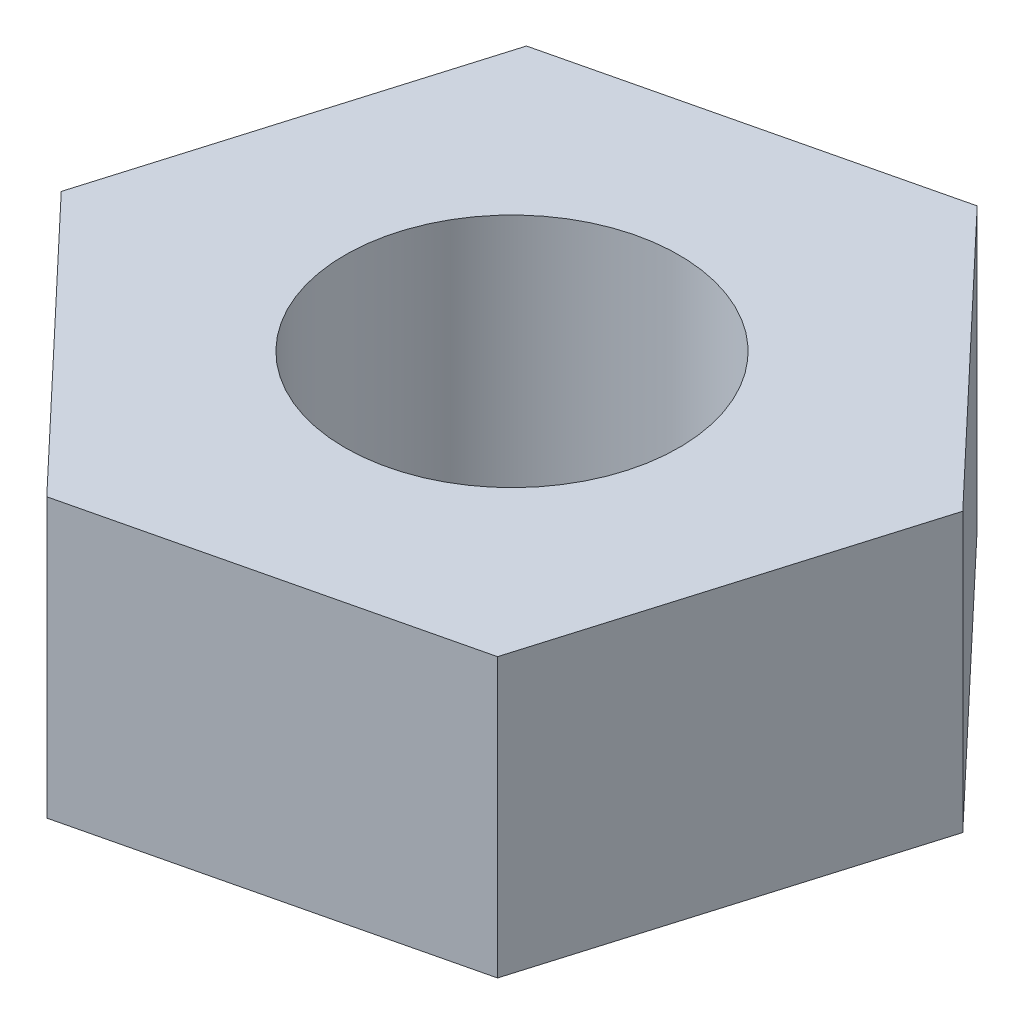
ISO-10303-21;
HEADER;
FILE_DESCRIPTION(('STEP AP214'),'2;1');
FILE_NAME('part.step','',(''),(''),'','','');
FILE_SCHEMA(('AUTOMOTIVE_DESIGN { 1 0 10303 214 1 1 1 1 }'));
ENDSEC;
DATA;
#1=APPLICATION_CONTEXT('core data for automotive mechanical design processes');
#2=APPLICATION_PROTOCOL_DEFINITION('international standard','automotive_design',2000,#1);
#3=PRODUCT_CONTEXT('',#1,'mechanical');
#4=PRODUCT('Part','Part','',(#3));
#5=PRODUCT_RELATED_PRODUCT_CATEGORY('part','',(#4));
#6=PRODUCT_DEFINITION_FORMATION('','',#4);
#7=PRODUCT_DEFINITION_CONTEXT('part definition',#1,'design');
#8=PRODUCT_DEFINITION('design','',#6,#7);
#9=PRODUCT_DEFINITION_SHAPE('','',#8);
#10=(LENGTH_UNIT() NAMED_UNIT(*) SI_UNIT(.MILLI.,.METRE.));
#11=(NAMED_UNIT(*) PLANE_ANGLE_UNIT() SI_UNIT($,.RADIAN.));
#12=(NAMED_UNIT(*) SI_UNIT($,.STERADIAN.) SOLID_ANGLE_UNIT());
#13=UNCERTAINTY_MEASURE_WITH_UNIT(LENGTH_MEASURE(1.E-05),#10,'distance_accuracy_value','');
#14=(GEOMETRIC_REPRESENTATION_CONTEXT(3) GLOBAL_UNCERTAINTY_ASSIGNED_CONTEXT((#13)) GLOBAL_UNIT_ASSIGNED_CONTEXT((#10,
#11,#12)) REPRESENTATION_CONTEXT('',''));
#15=CARTESIAN_POINT('',(0.,0.,0.));
#16=DIRECTION('',(0.,0.,1.));
#17=DIRECTION('',(1.,0.,0.));
#18=AXIS2_PLACEMENT_3D('',#15,#16,#17);
#19=CARTESIAN_POINT('',(-3.83322413342985,10.,12.8843393939421));
#20=DIRECTION('',(-0.232286318493333,0.,-0.972647452184405));
#21=DIRECTION('',(-0.972647452184405,0.,0.232286318493333));
#22=AXIS2_PLACEMENT_3D('',#19,#20,#21);
#23=PLANE('',#22);
#24=DIRECTION('',(0.972647452184405,0.,-0.232286318493333));
#25=VECTOR('',#24,1.);
#26=CARTESIAN_POINT('',(-3.83322413342985,0.,12.8843393939421));
#27=LINE('',#26,#25);
#28=CARTESIAN_POINT('',(-3.83322413342985,0.,12.8843393939421));
#29=VERTEX_POINT('',#28);
#30=CARTESIAN_POINT('',(9.24155315941951,0.,9.76183917492088));
#31=VERTEX_POINT('',#30);
#32=EDGE_CURVE('E117',#29,#31,#27,.T.);
#33=ORIENTED_EDGE('',*,*,#32,.T.);
#34=DIRECTION('',(0.,-1.,0.));
#35=VECTOR('',#34,1.);
#36=CARTESIAN_POINT('',(9.24155315941951,10.,9.76183917492088));
#37=LINE('',#36,#35);
#38=CARTESIAN_POINT('',(9.24155315941951,10.,9.76183917492088));
#39=VERTEX_POINT('',#38);
#40=EDGE_CURVE('E11',#39,#31,#37,.T.);
#41=ORIENTED_EDGE('',*,*,#40,.F.);
#42=DIRECTION('',(0.972647452184405,0.,-0.232286318493333));
#43=VECTOR('',#42,1.);
#44=CARTESIAN_POINT('',(-3.83322413342985,10.,12.8843393939421));
#45=LINE('',#44,#43);
#46=CARTESIAN_POINT('',(-3.83322413342985,10.,12.8843393939421));
#47=VERTEX_POINT('',#46);
#48=EDGE_CURVE('E128',#47,#39,#45,.T.);
#49=ORIENTED_EDGE('',*,*,#48,.F.);
#50=DIRECTION('',(0.,-1.,0.));
#51=VECTOR('',#50,1.);
#52=CARTESIAN_POINT('',(-3.83322413342985,10.,12.8843393939421));
#53=LINE('',#52,#51);
#54=EDGE_CURVE('E113',#47,#29,#53,.T.);
#55=ORIENTED_EDGE('',*,*,#54,.T.);
#56=EDGE_LOOP('',(#33,#41,#49,#55));
#57=FACE_BOUND('',#56,.T.);
#58=ADVANCED_FACE('F33',(#57),#23,.F.);
#59=CARTESIAN_POINT('',(9.24155315941951,10.,9.76183917492088));
#60=DIRECTION('',(-0.958480561764571,0.,-0.285157873325412));
#61=DIRECTION('',(-0.285157873325413,0.,0.958480561764571));
#62=AXIS2_PLACEMENT_3D('',#59,#60,#61);
#63=PLANE('',#62);
#64=DIRECTION('',(0.285157873325412,0.,-0.958480561764571));
#65=VECTOR('',#64,1.);
#66=CARTESIAN_POINT('',(9.24155315941951,0.,9.76183917492088));
#67=LINE('',#66,#65);
#68=CARTESIAN_POINT('',(13.0747772928494,0.,-3.1225002190212));
#69=VERTEX_POINT('',#68);
#70=EDGE_CURVE('E120',#31,#69,#67,.T.);
#71=ORIENTED_EDGE('',*,*,#70,.T.);
#72=DIRECTION('',(0.,-1.,0.));
#73=VECTOR('',#72,1.);
#74=CARTESIAN_POINT('',(13.0747772928494,10.,-3.1225002190212));
#75=LINE('',#74,#73);
#76=CARTESIAN_POINT('',(13.0747772928494,10.,-3.1225002190212));
#77=VERTEX_POINT('',#76);
#78=EDGE_CURVE('E41',#77,#69,#75,.T.);
#79=ORIENTED_EDGE('',*,*,#78,.F.);
#80=DIRECTION('',(0.285157873325412,0.,-0.958480561764571));
#81=VECTOR('',#80,1.);
#82=CARTESIAN_POINT('',(9.24155315941951,10.,9.76183917492088));
#83=LINE('',#82,#81);
#84=EDGE_CURVE('E86',#39,#77,#83,.T.);
#85=ORIENTED_EDGE('',*,*,#84,.F.);
#86=ORIENTED_EDGE('',*,*,#40,.T.);
#87=EDGE_LOOP('',(#71,#79,#85,#86));
#88=FACE_BOUND('',#87,.T.);
#89=ADVANCED_FACE('F153',(#88),#63,.F.);
#90=CARTESIAN_POINT('',(13.0747772928494,10.,-3.1225002190212));
#91=DIRECTION('',(-0.726194243271238,0.,0.687489578858992));
#92=DIRECTION('',(0.687489578858992,0.,0.726194243271238));
#93=AXIS2_PLACEMENT_3D('',#90,#91,#92);
#94=PLANE('',#93);
#95=DIRECTION('',(-0.687489578858992,0.,-0.726194243271238));
#96=VECTOR('',#95,1.);
#97=CARTESIAN_POINT('',(13.0747772928494,0.,-3.1225002190212));
#98=LINE('',#97,#96);
#99=CARTESIAN_POINT('',(3.83322413342985,0.,-12.8843393939421));
#100=VERTEX_POINT('',#99);
#101=EDGE_CURVE('E123',#69,#100,#98,.T.);
#102=ORIENTED_EDGE('',*,*,#101,.T.);
#103=DIRECTION('',(0.,-1.,0.));
#104=VECTOR('',#103,1.);
#105=CARTESIAN_POINT('',(3.83322413342985,10.,-12.8843393939421));
#106=LINE('',#105,#104);
#107=CARTESIAN_POINT('',(3.83322413342985,10.,-12.8843393939421));
#108=VERTEX_POINT('',#107);
#109=EDGE_CURVE('E108',#108,#100,#106,.T.);
#110=ORIENTED_EDGE('',*,*,#109,.F.);
#111=DIRECTION('',(-0.687489578858992,0.,-0.726194243271238));
#112=VECTOR('',#111,1.);
#113=CARTESIAN_POINT('',(13.0747772928494,10.,-3.1225002190212));
#114=LINE('',#113,#112);
#115=EDGE_CURVE('E99',#77,#108,#114,.T.);
#116=ORIENTED_EDGE('',*,*,#115,.F.);
#117=ORIENTED_EDGE('',*,*,#78,.T.);
#118=EDGE_LOOP('',(#102,#110,#116,#117));
#119=FACE_BOUND('',#118,.T.);
#120=ADVANCED_FACE('F134',(#119),#94,.F.);
#121=CARTESIAN_POINT('',(3.83322413342985,10.,-12.8843393939421));
#122=DIRECTION('',(0.232286318493333,0.,0.972647452184405));
#123=DIRECTION('',(0.972647452184405,0.,-0.232286318493333));
#124=AXIS2_PLACEMENT_3D('',#121,#122,#123);
#125=PLANE('',#124);
#126=DIRECTION('',(-0.972647452184405,0.,0.232286318493333));
#127=VECTOR('',#126,1.);
#128=CARTESIAN_POINT('',(3.83322413342985,0.,-12.8843393939421));
#129=LINE('',#128,#127);
#130=CARTESIAN_POINT('',(-9.24155315941951,0.,-9.76183917492089));
#131=VERTEX_POINT('',#130);
#132=EDGE_CURVE('E107',#100,#131,#129,.T.);
#133=ORIENTED_EDGE('',*,*,#132,.T.);
#134=DIRECTION('',(0.,-1.,0.));
#135=VECTOR('',#134,1.);
#136=CARTESIAN_POINT('',(-9.24155315941951,10.,-9.76183917492089));
#137=LINE('',#136,#135);
#138=CARTESIAN_POINT('',(-9.24155315941951,10.,-9.76183917492089));
#139=VERTEX_POINT('',#138);
#140=EDGE_CURVE('E104',#139,#131,#137,.T.);
#141=ORIENTED_EDGE('',*,*,#140,.F.);
#142=DIRECTION('',(-0.972647452184405,0.,0.232286318493333));
#143=VECTOR('',#142,1.);
#144=CARTESIAN_POINT('',(3.83322413342985,10.,-12.8843393939421));
#145=LINE('',#144,#143);
#146=EDGE_CURVE('E93',#108,#139,#145,.T.);
#147=ORIENTED_EDGE('',*,*,#146,.F.);
#148=ORIENTED_EDGE('',*,*,#109,.T.);
#149=EDGE_LOOP('',(#133,#141,#147,#148));
#150=FACE_BOUND('',#149,.T.);
#151=ADVANCED_FACE('F105',(#150),#125,.F.);
#152=CARTESIAN_POINT('',(-9.24155315941951,10.,-9.76183917492089));
#153=DIRECTION('',(0.958480561764571,0.,0.285157873325413));
#154=DIRECTION('',(0.285157873325413,0.,-0.958480561764571));
#155=AXIS2_PLACEMENT_3D('',#152,#153,#154);
#156=PLANE('',#155);
#157=DIRECTION('',(-0.285157873325413,0.,0.958480561764571));
#158=VECTOR('',#157,1.);
#159=CARTESIAN_POINT('',(-9.24155315941951,0.,-9.76183917492089));
#160=LINE('',#159,#158);
#161=CARTESIAN_POINT('',(-13.0747772928494,0.,3.12250021902119));
#162=VERTEX_POINT('',#161);
#163=EDGE_CURVE('E72',#131,#162,#160,.T.);
#164=ORIENTED_EDGE('',*,*,#163,.T.);
#165=DIRECTION('',(0.,-1.,0.));
#166=VECTOR('',#165,1.);
#167=CARTESIAN_POINT('',(-13.0747772928494,10.,3.12250021902119));
#168=LINE('',#167,#166);
#169=CARTESIAN_POINT('',(-13.0747772928494,10.,3.12250021902119));
#170=VERTEX_POINT('',#169);
#171=EDGE_CURVE('E109',#170,#162,#168,.T.);
#172=ORIENTED_EDGE('',*,*,#171,.F.);
#173=DIRECTION('',(-0.285157873325413,0.,0.958480561764571));
#174=VECTOR('',#173,1.);
#175=CARTESIAN_POINT('',(-9.24155315941951,10.,-9.76183917492089));
#176=LINE('',#175,#174);
#177=EDGE_CURVE('E97',#139,#170,#176,.T.);
#178=ORIENTED_EDGE('',*,*,#177,.F.);
#179=ORIENTED_EDGE('',*,*,#140,.T.);
#180=EDGE_LOOP('',(#164,#172,#178,#179));
#181=FACE_BOUND('',#180,.T.);
#182=ADVANCED_FACE('F111',(#181),#156,.F.);
#183=CARTESIAN_POINT('',(-13.0747772928494,10.,3.12250021902119));
#184=DIRECTION('',(0.726194243271238,0.,-0.687489578858992));
#185=DIRECTION('',(-0.687489578858992,0.,-0.726194243271238));
#186=AXIS2_PLACEMENT_3D('',#183,#184,#185);
#187=PLANE('',#186);
#188=DIRECTION('',(0.687489578858992,0.,0.726194243271238));
#189=VECTOR('',#188,1.);
#190=CARTESIAN_POINT('',(-13.0747772928494,0.,3.12250021902119));
#191=LINE('',#190,#189);
#192=EDGE_CURVE('E78',#162,#29,#191,.T.);
#193=ORIENTED_EDGE('',*,*,#192,.T.);
#194=ORIENTED_EDGE('',*,*,#54,.F.);
#195=DIRECTION('',(0.687489578858992,0.,0.726194243271238));
#196=VECTOR('',#195,1.);
#197=CARTESIAN_POINT('',(-13.0747772928494,10.,3.12250021902119));
#198=LINE('',#197,#196);
#199=EDGE_CURVE('E49',#170,#47,#198,.T.);
#200=ORIENTED_EDGE('',*,*,#199,.F.);
#201=ORIENTED_EDGE('',*,*,#171,.T.);
#202=EDGE_LOOP('',(#193,#194,#200,#201));
#203=FACE_BOUND('',#202,.T.);
#204=ADVANCED_FACE('F141',(#203),#187,.F.);
#205=CARTESIAN_POINT('',(0.,10.,0.));
#206=DIRECTION('',(0.,1.,0.));
#207=DIRECTION('',(0.,0.,1.));
#208=AXIS2_PLACEMENT_3D('',#205,#206,#207);
#209=PLANE('',#208);
#210=CARTESIAN_POINT('',(0.,10.,0.));
#211=DIRECTION('',(0.,1.,0.));
#212=DIRECTION('',(0.,0.,1.));
#213=AXIS2_PLACEMENT_3D('',#210,#211,#212);
#214=CIRCLE('',#213,6.);
#215=CARTESIAN_POINT('',(0.,10.,6.));
#216=VERTEX_POINT('',#215);
#217=EDGE_CURVE('E208',#216,#216,#214,.T.);
#218=ORIENTED_EDGE('',*,*,#217,.F.);
#219=EDGE_LOOP('',(#218));
#220=FACE_BOUND('',#219,.T.);
#221=ORIENTED_EDGE('',*,*,#48,.T.);
#222=ORIENTED_EDGE('',*,*,#84,.T.);
#223=ORIENTED_EDGE('',*,*,#115,.T.);
#224=ORIENTED_EDGE('',*,*,#146,.T.);
#225=ORIENTED_EDGE('',*,*,#177,.T.);
#226=ORIENTED_EDGE('',*,*,#199,.T.);
#227=EDGE_LOOP('',(#221,#222,#223,#224,#225,#226));
#228=FACE_BOUND('',#227,.T.);
#229=ADVANCED_FACE('F95',(#220,#228),#209,.T.);
#230=CARTESIAN_POINT('',(0.,0.,0.));
#231=DIRECTION('',(0.,1.,0.));
#232=DIRECTION('',(0.,0.,1.));
#233=AXIS2_PLACEMENT_3D('',#230,#231,#232);
#234=PLANE('',#233);
#235=CARTESIAN_POINT('',(0.,0.,0.));
#236=DIRECTION('',(0.,1.,0.));
#237=DIRECTION('',(0.,0.,1.));
#238=AXIS2_PLACEMENT_3D('',#235,#236,#237);
#239=CIRCLE('',#238,6.);
#240=CARTESIAN_POINT('',(0.,0.,6.));
#241=VERTEX_POINT('',#240);
#242=EDGE_CURVE('E121',#241,#241,#239,.T.);
#243=ORIENTED_EDGE('',*,*,#242,.T.);
#244=EDGE_LOOP('',(#243));
#245=FACE_BOUND('',#244,.T.);
#246=ORIENTED_EDGE('',*,*,#32,.F.);
#247=ORIENTED_EDGE('',*,*,#192,.F.);
#248=ORIENTED_EDGE('',*,*,#163,.F.);
#249=ORIENTED_EDGE('',*,*,#132,.F.);
#250=ORIENTED_EDGE('',*,*,#101,.F.);
#251=ORIENTED_EDGE('',*,*,#70,.F.);
#252=EDGE_LOOP('',(#246,#247,#248,#249,#250,#251));
#253=FACE_BOUND('',#252,.T.);
#254=ADVANCED_FACE('F137',(#245,#253),#234,.F.);
#255=CARTESIAN_POINT('',(0.,0.,0.));
#256=DIRECTION('',(0.,1.,0.));
#257=DIRECTION('',(0.,0.,1.));
#258=AXIS2_PLACEMENT_3D('',#255,#256,#257);
#259=CYLINDRICAL_SURFACE('',#258,6.);
#260=ORIENTED_EDGE('',*,*,#242,.F.);
#261=EDGE_LOOP('',(#260));
#262=FACE_BOUND('',#261,.T.);
#263=ORIENTED_EDGE('',*,*,#217,.T.);
#264=EDGE_LOOP('',(#263));
#265=FACE_BOUND('',#264,.T.);
#266=ADVANCED_FACE('F190',(#262,#265),#259,.F.);
#267=CLOSED_SHELL('',(#58,#89,#120,#151,#182,#204,#229,#254,#266));
#268=MANIFOLD_SOLID_BREP('B2',#267);
#269=ADVANCED_BREP_SHAPE_REPRESENTATION('',(#18,#268),#14);
#270=SHAPE_DEFINITION_REPRESENTATION(#9,#269);
ENDSEC;
END-ISO-10303-21;
